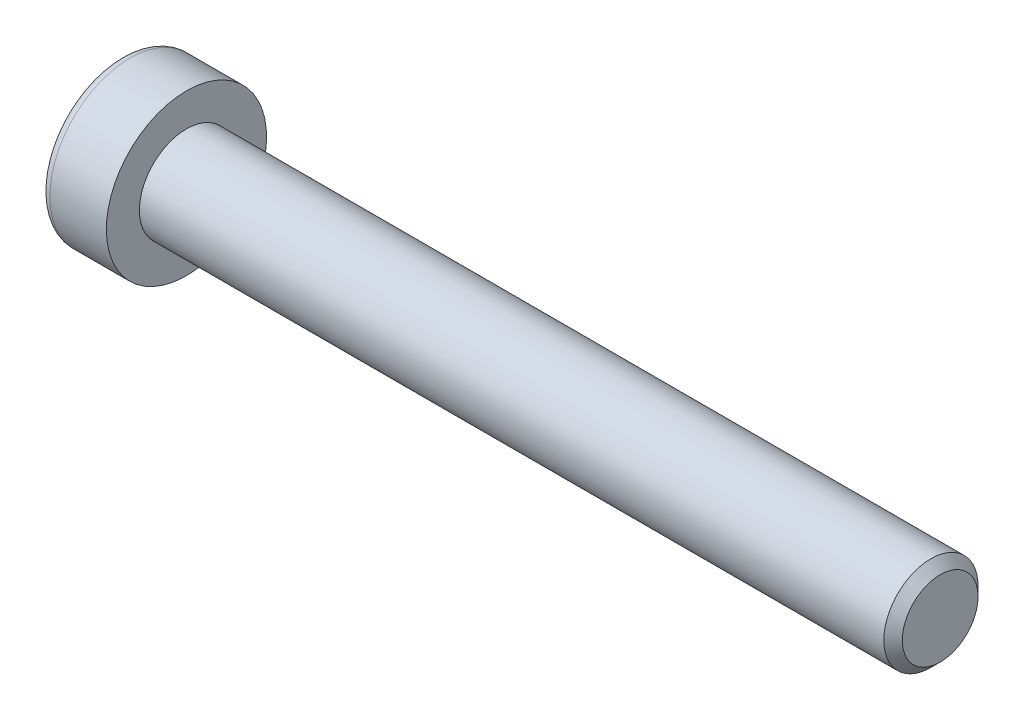
ISO-10303-21;
HEADER;
FILE_DESCRIPTION(('STEP AP214'),'2;1');
FILE_NAME('part.step','',(''),(''),'','','');
FILE_SCHEMA(('AUTOMOTIVE_DESIGN { 1 0 10303 214 1 1 1 1 }'));
ENDSEC;
DATA;
#1=APPLICATION_CONTEXT('core data for automotive mechanical design processes');
#2=APPLICATION_PROTOCOL_DEFINITION('international standard','automotive_design',2000,#1);
#3=PRODUCT_CONTEXT('',#1,'mechanical');
#4=PRODUCT('Part','Part','',(#3));
#5=PRODUCT_RELATED_PRODUCT_CATEGORY('part','',(#4));
#6=PRODUCT_DEFINITION_FORMATION('','',#4);
#7=PRODUCT_DEFINITION_CONTEXT('part definition',#1,'design');
#8=PRODUCT_DEFINITION('design','',#6,#7);
#9=PRODUCT_DEFINITION_SHAPE('','',#8);
#10=(LENGTH_UNIT() NAMED_UNIT(*) SI_UNIT(.MILLI.,.METRE.));
#11=(NAMED_UNIT(*) PLANE_ANGLE_UNIT() SI_UNIT($,.RADIAN.));
#12=(NAMED_UNIT(*) SI_UNIT($,.STERADIAN.) SOLID_ANGLE_UNIT());
#13=UNCERTAINTY_MEASURE_WITH_UNIT(LENGTH_MEASURE(1.E-05),#10,'distance_accuracy_value','');
#14=(GEOMETRIC_REPRESENTATION_CONTEXT(3) GLOBAL_UNCERTAINTY_ASSIGNED_CONTEXT((#13)) GLOBAL_UNIT_ASSIGNED_CONTEXT((#10,
#11,#12)) REPRESENTATION_CONTEXT('',''));
#15=CARTESIAN_POINT('',(0.,0.,0.));
#16=DIRECTION('',(0.,0.,1.));
#17=DIRECTION('',(1.,0.,0.));
#18=AXIS2_PLACEMENT_3D('',#15,#16,#17);
#19=CARTESIAN_POINT('',(-3.5,-1.5,0.866025403784439));
#20=DIRECTION('',(0.,-0.5,0.866025403784439));
#21=DIRECTION('',(0.,-0.866025403784439,-0.5));
#22=AXIS2_PLACEMENT_3D('',#19,#20,#21);
#23=PLANE('',#22);
#24=DIRECTION('',(1.,0.,0.));
#25=VECTOR('',#24,1.);
#26=CARTESIAN_POINT('',(-3.5,-1.5,0.866025403784438));
#27=LINE('',#26,#25);
#28=CARTESIAN_POINT('',(-0.799999988784535,-1.49999996234736,0.866025425523198));
#29=VERTEX_POINT('',#28);
#30=CARTESIAN_POINT('',(-3.5,-1.5,0.866025403784438));
#31=VERTEX_POINT('',#30);
#32=EDGE_CURVE('E78',#29,#31,#27,.F.);
#33=ORIENTED_EDGE('',*,*,#32,.T.);
#34=DIRECTION('',(0.,-0.866025403784439,-0.5));
#35=VECTOR('',#34,1.);
#36=CARTESIAN_POINT('',(-3.5,-1.5,0.866025403784439));
#37=LINE('',#36,#35);
#38=CARTESIAN_POINT('',(-3.5,0.,1.73205080756888));
#39=VERTEX_POINT('',#38);
#40=EDGE_CURVE('E90',#39,#31,#37,.T.);
#41=ORIENTED_EDGE('',*,*,#40,.F.);
#42=DIRECTION('',(1.,0.,0.));
#43=VECTOR('',#42,1.);
#44=CARTESIAN_POINT('',(-3.5,0.,1.73205080756888));
#45=LINE('',#44,#43);
#46=CARTESIAN_POINT('',(-0.799999997434989,1.17012725468216E-08,1.73205080081314));
#47=VERTEX_POINT('',#46);
#48=EDGE_CURVE('E73',#39,#47,#45,.T.);
#49=ORIENTED_EDGE('',*,*,#48,.T.);
#50=CARTESIAN_POINT('',(-0.800000004725339,-1.69415489776677E-08,1.73205077640564));
#51=CARTESIAN_POINT('',(-0.778021656625427,-0.0659159374341491,1.69399421566792));
#52=CARTESIAN_POINT('',(-0.758033503025184,-0.132400840644835,1.65560914452342));
#53=CARTESIAN_POINT('',(-0.723144784595883,-0.266521786297579,1.57817438456824));
#54=CARTESIAN_POINT('',(-0.708256560725856,-0.334160211026364,1.53912332032653));
#55=CARTESIAN_POINT('',(-0.685081966709531,-0.468598851891145,1.46150513375491));
#56=CARTESIAN_POINT('',(-0.676641338811509,-0.535378388698304,1.42294995059361));
#57=CARTESIAN_POINT('',(-0.666566875831205,-0.669251517992319,1.34565826364226));
#58=CARTESIAN_POINT('',(-0.664924696224289,-0.736344624221194,1.306922040594));
#59=CARTESIAN_POINT('',(-0.668349719973882,-0.861700886695846,1.23454756864313));
#60=CARTESIAN_POINT('',(-0.672575966074987,-0.919982853694455,1.2008984593302));
#61=CARTESIAN_POINT('',(-0.685967975850059,-1.03616709969408,1.13381945364342));
#62=CARTESIAN_POINT('',(-0.695138309726079,-1.09406897714516,1.10038978910451));
#63=CARTESIAN_POINT('',(-0.718062369057025,-1.21049257363325,1.03317259432721));
#64=CARTESIAN_POINT('',(-0.731913222744571,-1.26899956513068,0.999393567037933));
#65=CARTESIAN_POINT('',(-0.763348804872802,-1.38514116893886,0.93233918081762));
#66=CARTESIAN_POINT('',(-0.780926151949422,-1.44277726800872,0.899062963505823));
#67=CARTESIAN_POINT('',(-0.799999976245017,-1.49999992472881,0.866025447242282));
#68=B_SPLINE_CURVE_WITH_KNOTS('',3,(#50,#51,#52,#53,#54,#55,#56,#57,#58,#59,#60,#61,#62,#63,#64,
#65,#66,#67),.UNSPECIFIED.,.F.,.F.,(4,2,2,2,2,2,2,2,4),(0.,0.237762010105454,0.476095365231051,
0.708530707797841,0.940680670751713,1.14278081100185,1.34506808912529,1.55184112921391,
1.75820836140425),.UNSPECIFIED.);
#69=EDGE_CURVE('E19',#47,#29,#68,.T.);
#70=ORIENTED_EDGE('',*,*,#69,.T.);
#71=EDGE_LOOP('',(#33,#41,#49,#70));
#72=FACE_BOUND('',#71,.T.);
#73=ADVANCED_FACE('F15',(#72),#23,.F.);
#74=CARTESIAN_POINT('',(-3.5,-1.5,-0.866025403784438));
#75=DIRECTION('',(0.,-1.,0.));
#76=DIRECTION('',(0.,0.,-1.));
#77=AXIS2_PLACEMENT_3D('',#74,#75,#76);
#78=PLANE('',#77);
#79=DIRECTION('',(1.,0.,0.));
#80=VECTOR('',#79,1.);
#81=CARTESIAN_POINT('',(-3.5,-1.5,-0.866025403784438));
#82=LINE('',#81,#80);
#83=CARTESIAN_POINT('',(-0.799999988781389,-1.5,-0.86602536029602));
#84=VERTEX_POINT('',#83);
#85=CARTESIAN_POINT('',(-3.5,-1.5,-0.866025403784438));
#86=VERTEX_POINT('',#85);
#87=EDGE_CURVE('E217',#84,#86,#82,.F.);
#88=ORIENTED_EDGE('',*,*,#87,.T.);
#89=DIRECTION('',(0.,0.,-1.));
#90=VECTOR('',#89,1.);
#91=CARTESIAN_POINT('',(-3.5,-1.5,-0.866025403784438));
#92=LINE('',#91,#90);
#93=EDGE_CURVE('E89',#31,#86,#92,.T.);
#94=ORIENTED_EDGE('',*,*,#93,.F.);
#95=ORIENTED_EDGE('',*,*,#32,.F.);
#96=CARTESIAN_POINT('',(-0.800000033360599,-1.49999996274849,0.866025430238394));
#97=CARTESIAN_POINT('',(-0.778021676230977,-1.49999998662093,0.789912288054516));
#98=CARTESIAN_POINT('',(-0.758033517882433,-1.49999999641418,0.713142136039034));
#99=CARTESIAN_POINT('',(-0.723144793827644,-1.50000000359443,0.55827260636859));
#100=CARTESIAN_POINT('',(-0.708256569083705,-1.50000000095156,0.480170477876044));
#101=CARTESIAN_POINT('',(-0.685081972513645,-1.49999999907199,0.324934102246555));
#102=CARTESIAN_POINT('',(-0.676641342935872,-1.49999999975262,0.24782373351801));
#103=CARTESIAN_POINT('',(-0.666566877124456,-1.50000000024707,0.0932403553155959));
#104=CARTESIAN_POINT('',(-0.664924696369009,-1.50000000006196,0.0157679073243919));
#105=CARTESIAN_POINT('',(-0.668349718300732,-1.49999999994606,-0.128981041412214));
#106=CARTESIAN_POINT('',(-0.672575963773273,-1.49999999998546,-0.196279262942304));
#107=CARTESIAN_POINT('',(-0.685967972785372,-1.50000000001455,-0.330437280066879));
#108=CARTESIAN_POINT('',(-0.695138306525902,-1.5000000000042,-0.397296611991617));
#109=CARTESIAN_POINT('',(-0.718062366045008,-1.49999999999571,-0.531731007478431));
#110=CARTESIAN_POINT('',(-0.731913220079964,-1.49999999999786,-0.599289065138913));
#111=CARTESIAN_POINT('',(-0.763348803279346,-1.50000000000214,-0.73339784368996));
#112=CARTESIAN_POINT('',(-0.780926151080554,-1.50000000000427,-0.799950281341834));
#113=CARTESIAN_POINT('',(-0.79999997623802,-1.5,-0.866025316844515));
#114=B_SPLINE_CURVE_WITH_KNOTS('',3,(#96,#97,#98,#99,#100,#101,#102,#103,#104,#105,#106,#107,
#108,#109,#110,#111,#112,#113),.UNSPECIFIED.,.F.,.F.,(4,2,2,2,2,2,2,2,4),(0.,0.237762017428484,
0.476095379616977,0.708530728242579,0.940680697366892,1.14278084607558,1.34506813260236,
1.55184118193499,1.75820842343781),.UNSPECIFIED.);
#115=EDGE_CURVE('E83',#29,#84,#114,.T.);
#116=ORIENTED_EDGE('',*,*,#115,.T.);
#117=EDGE_LOOP('',(#88,#94,#95,#116));
#118=FACE_BOUND('',#117,.T.);
#119=ADVANCED_FACE('F87',(#118),#78,.F.);
#120=CARTESIAN_POINT('',(-3.5,0.,1.73205080756888));
#121=DIRECTION('',(0.,0.500000000000001,0.866025403784438));
#122=DIRECTION('',(0.,-0.866025403784438,0.500000000000001));
#123=AXIS2_PLACEMENT_3D('',#120,#121,#122);
#124=PLANE('',#123);
#125=ORIENTED_EDGE('',*,*,#48,.F.);
#126=DIRECTION('',(0.,-0.866025403784438,0.500000000000001));
#127=VECTOR('',#126,1.);
#128=CARTESIAN_POINT('',(-3.5,0.,1.73205080756888));
#129=LINE('',#128,#127);
#130=CARTESIAN_POINT('',(-3.5,1.5,0.866025403784437));
#131=VERTEX_POINT('',#130);
#132=EDGE_CURVE('E220',#131,#39,#129,.T.);
#133=ORIENTED_EDGE('',*,*,#132,.F.);
#134=DIRECTION('',(1.,0.,0.));
#135=VECTOR('',#134,1.);
#136=CARTESIAN_POINT('',(-3.5,1.5,0.866025403784437));
#137=LINE('',#136,#135);
#138=CARTESIAN_POINT('',(-0.799999988778824,1.5,0.866025360287134));
#139=VERTEX_POINT('',#138);
#140=EDGE_CURVE('E84',#131,#139,#137,.T.);
#141=ORIENTED_EDGE('',*,*,#140,.T.);
#142=CARTESIAN_POINT('',(-0.800000033372062,1.50000000426694,0.866025358282444));
#143=CARTESIAN_POINT('',(-0.778021676228766,1.4340841015016,0.904081950068873));
#144=CARTESIAN_POINT('',(-0.758033517872317,1.36759920448672,0.942467034572084));
#145=CARTESIAN_POINT('',(-0.723144793808397,1.23347826107579,1.01990180565004));
#146=CARTESIAN_POINT('',(-0.708256569063399,1.16583983236954,1.05895286761771));
#147=CARTESIAN_POINT('',(-0.68508197250049,1.03140118653812,1.13657105380642));
#148=CARTESIAN_POINT('',(-0.67664134292768,0.964621648680284,1.17512623875136));
#149=CARTESIAN_POINT('',(-0.666566877122698,0.83074851643595,1.25241792826115));
#150=CARTESIAN_POINT('',(-0.664924696368573,0.763655408308239,1.29115415208558));
#151=CARTESIAN_POINT('',(-0.668349718416017,0.638299137324193,1.36352862874893));
#152=CARTESIAN_POINT('',(-0.672575964380285,0.580017163710541,1.39717774194919));
#153=CARTESIAN_POINT('',(-0.68596797505178,0.46383290452543,1.46425675529893));
#154=CARTESIAN_POINT('',(-0.695138309961578,0.405931020503893,1.49768642361338));
#155=CARTESIAN_POINT('',(-0.718062372395979,0.28950741059194,1.56490362612627));
#156=CARTESIAN_POINT('',(-0.731913228198078,0.231000412248521,1.5986826573718));
#157=CARTESIAN_POINT('',(-0.763348815315962,0.114858794946651,1.6657370513901));
#158=CARTESIAN_POINT('',(-0.780926165266194,0.0572226892287438,1.69901327254384));
#159=CARTESIAN_POINT('',(-0.799999992684364,2.59531461259791E-08,1.73205079258482));
#160=B_SPLINE_CURVE_WITH_KNOTS('',3,(#142,#143,#144,#145,#146,#147,#148,#149,#150,#151,#152,
#153,#154,#155,#156,#157,#158,#159),.UNSPECIFIED.,.F.,.F.,(4,2,2,2,2,2,2,2,4),(0.,
0.23776201748951,0.476095379746017,0.708530728315269,0.940680697378029,1.14278086051372,
1.34506816152078,1.55184122608606,1.75820848270568),.UNSPECIFIED.);
#161=EDGE_CURVE('E120',#139,#47,#160,.T.);
#162=ORIENTED_EDGE('',*,*,#161,.T.);
#163=EDGE_LOOP('',(#125,#133,#141,#162));
#164=FACE_BOUND('',#163,.T.);
#165=ADVANCED_FACE('F113',(#164),#124,.F.);
#166=CARTESIAN_POINT('',(-3.5,0.,-1.73205080756888));
#167=DIRECTION('',(0.,-0.5,-0.866025403784439));
#168=DIRECTION('',(0.,0.866025403784439,-0.5));
#169=AXIS2_PLACEMENT_3D('',#166,#167,#168);
#170=PLANE('',#169);
#171=DIRECTION('',(1.,0.,0.));
#172=VECTOR('',#171,1.);
#173=CARTESIAN_POINT('',(-3.5,0.,-1.73205080756888));
#174=LINE('',#173,#172);
#175=CARTESIAN_POINT('',(-0.799999993542444,-5.19366415606353E-08,-1.73205079407106));
#176=VERTEX_POINT('',#175);
#177=CARTESIAN_POINT('',(-3.5,0.,-1.73205080756888));
#178=VERTEX_POINT('',#177);
#179=EDGE_CURVE('E125',#176,#178,#174,.F.);
#180=ORIENTED_EDGE('',*,*,#179,.T.);
#181=DIRECTION('',(0.,0.866025403784439,-0.5));
#182=VECTOR('',#181,1.);
#183=CARTESIAN_POINT('',(-3.5,0.,-1.73205080756888));
#184=LINE('',#183,#182);
#185=EDGE_CURVE('E38',#86,#178,#184,.T.);
#186=ORIENTED_EDGE('',*,*,#185,.F.);
#187=ORIENTED_EDGE('',*,*,#87,.F.);
#188=CARTESIAN_POINT('',(-0.800000033363575,-1.50000000425517,-0.86602535829566));
#189=CARTESIAN_POINT('',(-0.778021676228233,-1.43408410150411,-0.904081950069729));
#190=CARTESIAN_POINT('',(-0.758033517877581,-1.36759920450506,-0.942467034562113));
#191=CARTESIAN_POINT('',(-0.723144793821883,-1.23347826112951,-1.01990180561841));
#192=CARTESIAN_POINT('',(-0.708256569079144,-1.16583983244284,-1.05895286757523));
#193=CARTESIAN_POINT('',(-0.685081972510794,-1.03140118661545,-1.13657105376194));
#194=CARTESIAN_POINT('',(-0.676641342933538,-0.964621648741627,-1.17512623871599));
#195=CARTESIAN_POINT('',(-0.666566877123457,-0.830748516462472,-1.2524179282458));
#196=CARTESIAN_POINT('',(-0.664924696368832,-0.76365540831592,-1.29115415208114));
#197=CARTESIAN_POINT('',(-0.668349718302019,-0.638299141481661,-1.36352862634863));
#198=CARTESIAN_POINT('',(-0.672575963775117,-0.580017172027697,-1.39717773714729));
#199=CARTESIAN_POINT('',(-0.685967972788137,-0.463832921092855,-1.46425674573372));
#200=CARTESIAN_POINT('',(-0.695138306529029,-0.405931041161734,-1.49768641168657));
#201=CARTESIAN_POINT('',(-0.718062366048673,-0.289507439525338,-1.56490360942157));
#202=CARTESIAN_POINT('',(-0.731913220083803,-0.231000445362995,-1.59868263825315));
#203=CARTESIAN_POINT('',(-0.763348803283375,-0.114858836271168,-1.66573702753138));
#204=CARTESIAN_POINT('',(-0.7809261510846,-0.0572227345827763,-1.69901324635868));
#205=CARTESIAN_POINT('',(-0.799999976242018,-7.5280188267289E-08,-1.73205076410584));
#206=B_SPLINE_CURVE_WITH_KNOTS('',3,(#188,#189,#190,#191,#192,#193,#194,#195,#196,#197,#198,
#199,#200,#201,#202,#203,#204,#205),.UNSPECIFIED.,.F.,.F.,(4,2,2,2,2,2,2,2,4),(0.,
0.237762017429711,0.476095379619096,0.70853072824518,0.940680697370112,1.14278084607582,
1.34506813259954,1.55184118192924,1.75820842342926),.UNSPECIFIED.);
#207=EDGE_CURVE('E96',#84,#176,#206,.T.);
#208=ORIENTED_EDGE('',*,*,#207,.T.);
#209=EDGE_LOOP('',(#180,#186,#187,#208));
#210=FACE_BOUND('',#209,.T.);
#211=ADVANCED_FACE('F116',(#210),#170,.F.);
#212=CARTESIAN_POINT('',(-3.5,1.5,0.866025403784437));
#213=DIRECTION('',(0.,1.,0.));
#214=DIRECTION('',(0.,0.,1.));
#215=AXIS2_PLACEMENT_3D('',#212,#213,#214);
#216=PLANE('',#215);
#217=ORIENTED_EDGE('',*,*,#140,.F.);
#218=DIRECTION('',(0.,0.,1.));
#219=VECTOR('',#218,1.);
#220=CARTESIAN_POINT('',(-3.5,1.5,0.866025403784437));
#221=LINE('',#220,#219);
#222=CARTESIAN_POINT('',(-3.5,1.5,-0.866025403784439));
#223=VERTEX_POINT('',#222);
#224=EDGE_CURVE('E213',#223,#131,#221,.T.);
#225=ORIENTED_EDGE('',*,*,#224,.F.);
#226=DIRECTION('',(1.,0.,0.));
#227=VECTOR('',#226,1.);
#228=CARTESIAN_POINT('',(-3.5,1.5,-0.866025403784439));
#229=LINE('',#228,#227);
#230=CARTESIAN_POINT('',(-0.800000001283258,1.5,-0.866025403603766));
#231=VERTEX_POINT('',#230);
#232=EDGE_CURVE('E204',#223,#231,#229,.T.);
#233=ORIENTED_EDGE('',*,*,#232,.T.);
#234=CARTESIAN_POINT('',(-0.800000001084292,1.50000000024293,-0.866025403465473));
#235=CARTESIAN_POINT('',(-0.778021659978541,1.50000000008725,-0.789912260155749));
#236=CARTESIAN_POINT('',(-0.758033508955871,1.50000000002339,-0.713142109287034));
#237=CARTESIAN_POINT('',(-0.723144791636943,1.49999999997656,-0.558272583748615));
#238=CARTESIAN_POINT('',(-0.708256566299037,1.4999999999938,-0.480170458242938));
#239=CARTESIAN_POINT('',(-0.685081970192622,1.50000000000605,-0.324934087660008));
#240=CARTESIAN_POINT('',(-0.676641341663123,1.50000000000161,-0.247823720996867));
#241=CARTESIAN_POINT('',(-0.666566877051741,1.49999999999839,-0.0932403472093147));
#242=CARTESIAN_POINT('',(-0.664924696440738,1.4999999999996,-0.0157679015679003));
#243=CARTESIAN_POINT('',(-0.668349718433718,1.50000000000035,0.128981044650931));
#244=CARTESIAN_POINT('',(-0.672575963999353,1.5000000000001,0.196279266004148));
#245=CARTESIAN_POINT('',(-0.685967973140108,1.49999999999991,0.330437282822451));
#246=CARTESIAN_POINT('',(-0.695138306920401,1.49999999999997,0.397296614617346));
#247=CARTESIAN_POINT('',(-0.718062366459124,1.50000000000003,0.531731009587171));
#248=CARTESIAN_POINT('',(-0.731913220456431,1.50000000000002,0.599289066863566));
#249=CARTESIAN_POINT('',(-0.76334880351463,1.49999999999999,0.733397844575311));
#250=CARTESIAN_POINT('',(-0.780926151207851,1.49999999999997,0.799950281773012));
#251=CARTESIAN_POINT('',(-0.799999976233145,1.5,0.866025316827626));
#252=B_SPLINE_CURVE_WITH_KNOTS('',3,(#234,#235,#236,#237,#238,#239,#240,#241,#242,#243,#244,
#245,#246,#247,#248,#249,#250,#251),.UNSPECIFIED.,.F.,.F.,(4,2,2,2,2,2,2,2,4),(0.,
0.237762008622012,0.47609536267599,0.708530704635084,0.940680666812864,1.14278081498717,
1.34506810115338,1.55184114933507,1.7582083894391),.UNSPECIFIED.);
#253=EDGE_CURVE('E97',#231,#139,#252,.T.);
#254=ORIENTED_EDGE('',*,*,#253,.T.);
#255=EDGE_LOOP('',(#217,#225,#233,#254));
#256=FACE_BOUND('',#255,.T.);
#257=ADVANCED_FACE('F135',(#256),#216,.F.);
#258=CARTESIAN_POINT('',(-0.806000000977747,0.,0.));
#259=DIRECTION('',(-1.,0.,0.));
#260=DIRECTION('',(0.,0.,1.));
#261=AXIS2_PLACEMENT_3D('',#258,#259,#260);
#262=CONICAL_SURFACE('',#261,1.74244311176608,1.04719755000012);
#263=CARTESIAN_POINT('',(0.200000001427725,0.,0.));
#264=VERTEX_POINT('',#263);
#265=VERTEX_LOOP('',#264);
#266=FACE_BOUND('',#265,.T.);
#267=ORIENTED_EDGE('',*,*,#253,.F.);
#268=CARTESIAN_POINT('',(-0.80000000108429,1.49999999984523,-0.866025404154304));
#269=CARTESIAN_POINT('',(-0.778021659967978,1.4340840840672,-0.904081975692867));
#270=CARTESIAN_POINT('',(-0.758033508936522,1.36759918309812,-0.942467051090669));
#271=CARTESIAN_POINT('',(-0.723144791604476,1.23347823961635,-1.01990181385977));
#272=CARTESIAN_POINT('',(-0.708256566262566,1.16583981480986,-1.05895287664926));
#273=CARTESIAN_POINT('',(-0.685081970168555,1.03140117429421,-1.13657106195461));
#274=CARTESIAN_POINT('',(-0.676641341648951,0.964621637899408,-1.17512624526338));
#275=CARTESIAN_POINT('',(-0.666566877049454,0.830748509266682,-1.25241793211302));
#276=CARTESIAN_POINT('',(-0.664924696440134,0.763655403287308,-1.29115415491237));
#277=CARTESIAN_POINT('',(-0.668349718662889,0.63829913038747,-1.36352863281657));
#278=CARTESIAN_POINT('',(-0.672575965212025,0.580017152741362,-1.39717774829916));
#279=CARTESIAN_POINT('',(-0.685967977672845,0.463832885544433,-1.46425676624069));
#280=CARTESIAN_POINT('',(-0.695138313792908,0.405930997544104,-1.49768643686434));
#281=CARTESIAN_POINT('',(-0.71806237916571,0.289507379796528,-1.564903643911));
#282=CARTESIAN_POINT('',(-0.731913236699584,0.231000377597556,-1.59868267738004));
#283=CARTESIAN_POINT('',(-0.763348827600062,0.114858752798563,-1.66573707572183));
#284=CARTESIAN_POINT('',(-0.780926179594314,0.0572226434376347,-1.69901329897638));
#285=CARTESIAN_POINT('',(-0.800000009144233,-2.34264601319575E-08,-1.73205082109415));
#286=B_SPLINE_CURVE_WITH_KNOTS('',3,(#268,#269,#270,#271,#272,#273,#274,#275,#276,#277,#278,
#279,#280,#281,#282,#283,#284,#285),.UNSPECIFIED.,.F.,.F.,(4,2,2,2,2,2,2,2,4),(0.,
0.237762008737361,0.4760953629215,0.708530704763243,0.940680666812919,1.14278084386533,
1.34506815901649,1.55184123768829,1.75820850805029),.UNSPECIFIED.);
#287=EDGE_CURVE('E126',#231,#176,#286,.T.);
#288=ORIENTED_EDGE('',*,*,#287,.T.);
#289=ORIENTED_EDGE('',*,*,#207,.F.);
#290=ORIENTED_EDGE('',*,*,#115,.F.);
#291=ORIENTED_EDGE('',*,*,#69,.F.);
#292=ORIENTED_EDGE('',*,*,#161,.F.);
#293=EDGE_LOOP('',(#267,#288,#289,#290,#291,#292));
#294=FACE_BOUND('',#293,.T.);
#295=ADVANCED_FACE('F94',(#266,#294),#262,.F.);
#296=CARTESIAN_POINT('',(-3.5,1.5,-0.866025403784439));
#297=DIRECTION('',(0.,0.5,-0.866025403784439));
#298=DIRECTION('',(0.,0.866025403784439,0.5));
#299=AXIS2_PLACEMENT_3D('',#296,#297,#298);
#300=PLANE('',#299);
#301=ORIENTED_EDGE('',*,*,#232,.F.);
#302=DIRECTION('',(0.,0.866025403784439,0.5));
#303=VECTOR('',#302,1.);
#304=CARTESIAN_POINT('',(-3.5,0.,-1.73205080756888));
#305=LINE('',#304,#303);
#306=EDGE_CURVE('E215',#178,#223,#305,.T.);
#307=ORIENTED_EDGE('',*,*,#306,.F.);
#308=ORIENTED_EDGE('',*,*,#179,.F.);
#309=ORIENTED_EDGE('',*,*,#287,.F.);
#310=EDGE_LOOP('',(#301,#307,#308,#309));
#311=FACE_BOUND('',#310,.T.);
#312=ADVANCED_FACE('F144',(#311),#300,.F.);
#313=CARTESIAN_POINT('',(-3.5,2.99102540378444,0.));
#314=DIRECTION('',(-1.,0.,0.));
#315=DIRECTION('',(0.,0.,1.));
#316=AXIS2_PLACEMENT_3D('',#313,#314,#315);
#317=PLANE('',#316);
#318=ORIENTED_EDGE('',*,*,#185,.T.);
#319=ORIENTED_EDGE('',*,*,#306,.T.);
#320=ORIENTED_EDGE('',*,*,#224,.T.);
#321=ORIENTED_EDGE('',*,*,#132,.T.);
#322=ORIENTED_EDGE('',*,*,#40,.T.);
#323=ORIENTED_EDGE('',*,*,#93,.T.);
#324=EDGE_LOOP('',(#318,#319,#320,#321,#322,#323));
#325=FACE_BOUND('',#324,.T.);
#326=CARTESIAN_POINT('',(-3.5,0.,0.));
#327=DIRECTION('',(1.,0.,0.));
#328=DIRECTION('',(0.,1.,0.));
#329=AXIS2_PLACEMENT_3D('',#326,#327,#328);
#330=CIRCLE('',#329,3.75);
#331=CARTESIAN_POINT('',(-3.5,3.75,0.));
#332=VERTEX_POINT('',#331);
#333=EDGE_CURVE('E191',#332,#332,#330,.T.);
#334=ORIENTED_EDGE('',*,*,#333,.F.);
#335=EDGE_LOOP('',(#334));
#336=FACE_BOUND('',#335,.T.);
#337=ADVANCED_FACE('F178',(#325,#336),#317,.T.);
#338=CARTESIAN_POINT('',(-3.,0.,0.));
#339=DIRECTION('',(1.,0.,0.));
#340=DIRECTION('',(0.,0.,-1.));
#341=AXIS2_PLACEMENT_3D('',#338,#339,#340);
#342=TOROIDAL_SURFACE('',#341,3.75,0.5);
#343=CARTESIAN_POINT('',(-3.,0.,0.));
#344=DIRECTION('',(1.,0.,0.));
#345=DIRECTION('',(0.,1.,0.));
#346=AXIS2_PLACEMENT_3D('',#343,#344,#345);
#347=CIRCLE('',#346,4.25);
#348=CARTESIAN_POINT('',(-3.,4.25,0.));
#349=VERTEX_POINT('',#348);
#350=EDGE_CURVE('E231',#349,#349,#347,.T.);
#351=ORIENTED_EDGE('',*,*,#350,.F.);
#352=EDGE_LOOP('',(#351));
#353=FACE_BOUND('',#352,.T.);
#354=ORIENTED_EDGE('',*,*,#333,.T.);
#355=EDGE_LOOP('',(#354));
#356=FACE_BOUND('',#355,.T.);
#357=ADVANCED_FACE('F172',(#353,#356),#342,.T.);
#358=CARTESIAN_POINT('',(-1.75,0.,0.));
#359=DIRECTION('',(1.,0.,0.));
#360=DIRECTION('',(0.,1.,0.));
#361=AXIS2_PLACEMENT_3D('',#358,#359,#360);
#362=CYLINDRICAL_SURFACE('',#361,4.25);
#363=ORIENTED_EDGE('',*,*,#350,.T.);
#364=EDGE_LOOP('',(#363));
#365=FACE_BOUND('',#364,.T.);
#366=CARTESIAN_POINT('',(0.,0.,0.));
#367=DIRECTION('',(1.,0.,0.));
#368=DIRECTION('',(0.,1.,0.));
#369=AXIS2_PLACEMENT_3D('',#366,#367,#368);
#370=CIRCLE('',#369,4.25);
#371=CARTESIAN_POINT('',(0.,4.25,0.));
#372=VERTEX_POINT('',#371);
#373=EDGE_CURVE('E229',#372,#372,#370,.T.);
#374=ORIENTED_EDGE('',*,*,#373,.F.);
#375=EDGE_LOOP('',(#374));
#376=FACE_BOUND('',#375,.T.);
#377=ADVANCED_FACE('F168',(#365,#376),#362,.T.);
#378=CARTESIAN_POINT('',(40.,1.25,0.));
#379=DIRECTION('',(1.,0.,0.));
#380=DIRECTION('',(0.,0.,-1.));
#381=AXIS2_PLACEMENT_3D('',#378,#379,#380);
#382=PLANE('',#381);
#383=CARTESIAN_POINT('',(40.0000000002478,0.,0.));
#384=DIRECTION('',(-1.,0.,0.));
#385=DIRECTION('',(0.,0.,1.));
#386=AXIS2_PLACEMENT_3D('',#383,#384,#385);
#387=CIRCLE('',#386,2.00924000017721);
#388=CARTESIAN_POINT('',(40.0000000002478,0.,2.00924000017721));
#389=VERTEX_POINT('',#388);
#390=EDGE_CURVE('E227',#389,#389,#387,.T.);
#391=ORIENTED_EDGE('',*,*,#390,.F.);
#392=EDGE_LOOP('',(#391));
#393=FACE_BOUND('',#392,.T.);
#394=ADVANCED_FACE('F164',(#393),#382,.T.);
#395=CARTESIAN_POINT('',(0.,3.375,0.));
#396=DIRECTION('',(1.,0.,0.));
#397=DIRECTION('',(0.,0.,-1.));
#398=AXIS2_PLACEMENT_3D('',#395,#396,#397);
#399=PLANE('',#398);
#400=CARTESIAN_POINT('',(0.,0.,0.));
#401=DIRECTION('',(1.,0.,0.));
#402=DIRECTION('',(0.,1.,0.));
#403=AXIS2_PLACEMENT_3D('',#400,#401,#402);
#404=CIRCLE('',#403,2.5);
#405=CARTESIAN_POINT('',(0.,2.5,0.));
#406=VERTEX_POINT('',#405);
#407=EDGE_CURVE('E29',#406,#406,#404,.T.);
#408=ORIENTED_EDGE('',*,*,#407,.F.);
#409=EDGE_LOOP('',(#408));
#410=FACE_BOUND('',#409,.T.);
#411=ORIENTED_EDGE('',*,*,#373,.T.);
#412=EDGE_LOOP('',(#411));
#413=FACE_BOUND('',#412,.T.);
#414=ADVANCED_FACE('F157',(#410,#413),#399,.T.);
#415=CARTESIAN_POINT('',(39.5092399998589,0.,0.));
#416=DIRECTION('',(-1.,0.,0.));
#417=DIRECTION('',(0.,0.,1.));
#418=AXIS2_PLACEMENT_3D('',#415,#416,#417);
#419=CONICAL_SURFACE('',#418,2.49999999971351,0.785398162528743);
#420=ORIENTED_EDGE('',*,*,#390,.T.);
#421=EDGE_LOOP('',(#420));
#422=FACE_BOUND('',#421,.T.);
#423=CARTESIAN_POINT('',(39.50924,0.,0.));
#424=DIRECTION('',(1.,0.,0.));
#425=DIRECTION('',(0.,1.,0.));
#426=AXIS2_PLACEMENT_3D('',#423,#424,#425);
#427=CIRCLE('',#426,2.5);
#428=CARTESIAN_POINT('',(39.50924,2.5,0.));
#429=VERTEX_POINT('',#428);
#430=EDGE_CURVE('E10',#429,#429,#427,.F.);
#431=ORIENTED_EDGE('',*,*,#430,.F.);
#432=EDGE_LOOP('',(#431));
#433=FACE_BOUND('',#432,.T.);
#434=ADVANCED_FACE('F150',(#422,#433),#419,.T.);
#435=CARTESIAN_POINT('',(32.,0.,0.));
#436=DIRECTION('',(1.,0.,0.));
#437=DIRECTION('',(0.,1.,0.));
#438=AXIS2_PLACEMENT_3D('',#435,#436,#437);
#439=CYLINDRICAL_SURFACE('',#438,2.5);
#440=ORIENTED_EDGE('',*,*,#430,.T.);
#441=EDGE_LOOP('',(#440));
#442=FACE_BOUND('',#441,.T.);
#443=ORIENTED_EDGE('',*,*,#407,.T.);
#444=EDGE_LOOP('',(#443));
#445=FACE_BOUND('',#444,.T.);
#446=ADVANCED_FACE('F148',(#442,#445),#439,.T.);
#447=CLOSED_SHELL('',(#73,#119,#165,#211,#257,#295,#312,#337,#357,#377,#394,#414,#434,#446));
#448=MANIFOLD_SOLID_BREP('B1',#447);
#449=ADVANCED_BREP_SHAPE_REPRESENTATION('',(#18,#448),#14);
#450=SHAPE_DEFINITION_REPRESENTATION(#9,#449);
ENDSEC;
END-ISO-10303-21;
